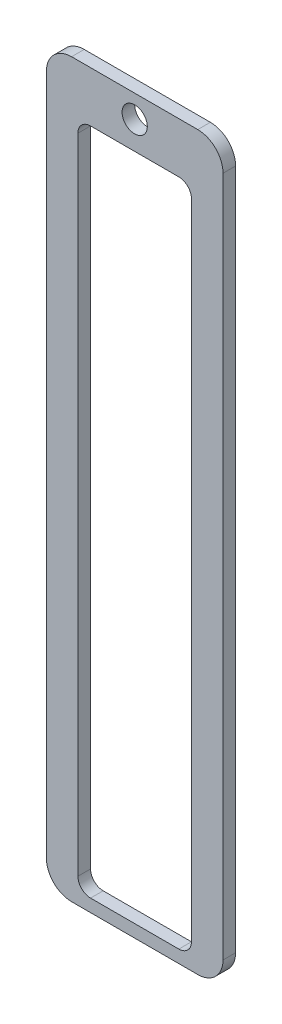
ISO-10303-21;
HEADER;
FILE_DESCRIPTION(('STEP AP214'),'2;1');
FILE_NAME('part.step','',(''),(''),'','','');
FILE_SCHEMA(('AUTOMOTIVE_DESIGN { 1 0 10303 214 1 1 1 1 }'));
ENDSEC;
DATA;
#1=APPLICATION_CONTEXT('core data for automotive mechanical design processes');
#2=APPLICATION_PROTOCOL_DEFINITION('international standard','automotive_design',2000,#1);
#3=PRODUCT_CONTEXT('',#1,'mechanical');
#4=PRODUCT('Part','Part','',(#3));
#5=PRODUCT_RELATED_PRODUCT_CATEGORY('part','',(#4));
#6=PRODUCT_DEFINITION_FORMATION('','',#4);
#7=PRODUCT_DEFINITION_CONTEXT('part definition',#1,'design');
#8=PRODUCT_DEFINITION('design','',#6,#7);
#9=PRODUCT_DEFINITION_SHAPE('','',#8);
#10=(LENGTH_UNIT() NAMED_UNIT(*) SI_UNIT(.MILLI.,.METRE.));
#11=(NAMED_UNIT(*) PLANE_ANGLE_UNIT() SI_UNIT($,.RADIAN.));
#12=(NAMED_UNIT(*) SI_UNIT($,.STERADIAN.) SOLID_ANGLE_UNIT());
#13=UNCERTAINTY_MEASURE_WITH_UNIT(LENGTH_MEASURE(1.E-05),#10,'distance_accuracy_value','');
#14=(GEOMETRIC_REPRESENTATION_CONTEXT(3) GLOBAL_UNCERTAINTY_ASSIGNED_CONTEXT((#13)) GLOBAL_UNIT_ASSIGNED_CONTEXT((#10,
#11,#12)) REPRESENTATION_CONTEXT('',''));
#15=CARTESIAN_POINT('',(0.,0.,0.));
#16=DIRECTION('',(0.,0.,1.));
#17=DIRECTION('',(1.,0.,0.));
#18=AXIS2_PLACEMENT_3D('',#15,#16,#17);
#19=CARTESIAN_POINT('',(25.,-280.,5.));
#20=DIRECTION('',(0.,0.,-1.));
#21=DIRECTION('',(-1.,0.,0.));
#22=AXIS2_PLACEMENT_3D('',#19,#20,#21);
#23=CYLINDRICAL_SURFACE('',#22,10.);
#24=CARTESIAN_POINT('',(25.,-280.,0.));
#25=DIRECTION('',(0.,0.,1.));
#26=DIRECTION('',(1.,0.,0.));
#27=AXIS2_PLACEMENT_3D('',#24,#25,#26);
#28=CIRCLE('',#27,10.);
#29=CARTESIAN_POINT('',(25.,-290.,0.));
#30=VERTEX_POINT('',#29);
#31=CARTESIAN_POINT('',(35.,-280.,0.));
#32=VERTEX_POINT('',#31);
#33=EDGE_CURVE('E247',#30,#32,#28,.T.);
#34=ORIENTED_EDGE('',*,*,#33,.T.);
#35=DIRECTION('',(0.,0.,-1.));
#36=VECTOR('',#35,1.);
#37=CARTESIAN_POINT('',(35.,-280.,5.));
#38=LINE('',#37,#36);
#39=CARTESIAN_POINT('',(35.,-280.,5.));
#40=VERTEX_POINT('',#39);
#41=EDGE_CURVE('E11',#40,#32,#38,.T.);
#42=ORIENTED_EDGE('',*,*,#41,.F.);
#43=CARTESIAN_POINT('',(25.,-280.,5.));
#44=DIRECTION('',(0.,0.,1.));
#45=DIRECTION('',(1.,0.,0.));
#46=AXIS2_PLACEMENT_3D('',#43,#44,#45);
#47=CIRCLE('',#46,10.);
#48=CARTESIAN_POINT('',(25.,-290.,5.));
#49=VERTEX_POINT('',#48);
#50=EDGE_CURVE('E220',#49,#40,#47,.T.);
#51=ORIENTED_EDGE('',*,*,#50,.F.);
#52=DIRECTION('',(0.,0.,-1.));
#53=VECTOR('',#52,1.);
#54=CARTESIAN_POINT('',(25.,-290.,5.));
#55=LINE('',#54,#53);
#56=EDGE_CURVE('E246',#49,#30,#55,.T.);
#57=ORIENTED_EDGE('',*,*,#56,.T.);
#58=EDGE_LOOP('',(#34,#42,#51,#57));
#59=FACE_BOUND('',#58,.T.);
#60=ADVANCED_FACE('F43',(#59),#23,.T.);
#61=CARTESIAN_POINT('',(35.,-280.,5.));
#62=DIRECTION('',(-1.,0.,0.));
#63=DIRECTION('',(0.,-1.,0.));
#64=AXIS2_PLACEMENT_3D('',#61,#62,#63);
#65=PLANE('',#64);
#66=DIRECTION('',(0.,1.,0.));
#67=VECTOR('',#66,1.);
#68=CARTESIAN_POINT('',(35.,-280.,0.));
#69=LINE('',#68,#67);
#70=CARTESIAN_POINT('',(35.,-10.,0.));
#71=VERTEX_POINT('',#70);
#72=EDGE_CURVE('E251',#32,#71,#69,.T.);
#73=ORIENTED_EDGE('',*,*,#72,.T.);
#74=DIRECTION('',(0.,0.,-1.));
#75=VECTOR('',#74,1.);
#76=CARTESIAN_POINT('',(35.,-10.,5.));
#77=LINE('',#76,#75);
#78=CARTESIAN_POINT('',(35.,-10.,5.));
#79=VERTEX_POINT('',#78);
#80=EDGE_CURVE('E51',#79,#71,#77,.T.);
#81=ORIENTED_EDGE('',*,*,#80,.F.);
#82=DIRECTION('',(0.,1.,0.));
#83=VECTOR('',#82,1.);
#84=CARTESIAN_POINT('',(35.,-280.,5.));
#85=LINE('',#84,#83);
#86=EDGE_CURVE('E224',#40,#79,#85,.T.);
#87=ORIENTED_EDGE('',*,*,#86,.F.);
#88=ORIENTED_EDGE('',*,*,#41,.T.);
#89=EDGE_LOOP('',(#73,#81,#87,#88));
#90=FACE_BOUND('',#89,.T.);
#91=ADVANCED_FACE('F320',(#90),#65,.F.);
#92=CARTESIAN_POINT('',(25.,-10.,5.));
#93=DIRECTION('',(0.,0.,-1.));
#94=DIRECTION('',(-1.,0.,0.));
#95=AXIS2_PLACEMENT_3D('',#92,#93,#94);
#96=CYLINDRICAL_SURFACE('',#95,10.);
#97=CARTESIAN_POINT('',(25.,-10.,0.));
#98=DIRECTION('',(0.,0.,1.));
#99=DIRECTION('',(-1.,0.,0.));
#100=AXIS2_PLACEMENT_3D('',#97,#98,#99);
#101=CIRCLE('',#100,10.);
#102=CARTESIAN_POINT('',(25.,0.,0.));
#103=VERTEX_POINT('',#102);
#104=EDGE_CURVE('E254',#71,#103,#101,.T.);
#105=ORIENTED_EDGE('',*,*,#104,.T.);
#106=DIRECTION('',(0.,0.,-1.));
#107=VECTOR('',#106,1.);
#108=CARTESIAN_POINT('',(25.,0.,5.));
#109=LINE('',#108,#107);
#110=CARTESIAN_POINT('',(25.,0.,5.));
#111=VERTEX_POINT('',#110);
#112=EDGE_CURVE('E290',#111,#103,#109,.T.);
#113=ORIENTED_EDGE('',*,*,#112,.F.);
#114=CARTESIAN_POINT('',(25.,-10.,5.));
#115=DIRECTION('',(0.,0.,1.));
#116=DIRECTION('',(-1.,0.,0.));
#117=AXIS2_PLACEMENT_3D('',#114,#115,#116);
#118=CIRCLE('',#117,10.);
#119=EDGE_CURVE('E228',#79,#111,#118,.T.);
#120=ORIENTED_EDGE('',*,*,#119,.F.);
#121=ORIENTED_EDGE('',*,*,#80,.T.);
#122=EDGE_LOOP('',(#105,#113,#120,#121));
#123=FACE_BOUND('',#122,.T.);
#124=ADVANCED_FACE('F299',(#123),#96,.T.);
#125=CARTESIAN_POINT('',(-25.,0.,5.));
#126=DIRECTION('',(0.,-1.,0.));
#127=DIRECTION('',(0.,0.,-1.));
#128=AXIS2_PLACEMENT_3D('',#125,#126,#127);
#129=PLANE('',#128);
#130=DIRECTION('',(-1.,0.,0.));
#131=VECTOR('',#130,1.);
#132=CARTESIAN_POINT('',(-25.,0.,0.));
#133=LINE('',#132,#131);
#134=CARTESIAN_POINT('',(-25.,0.,0.));
#135=VERTEX_POINT('',#134);
#136=EDGE_CURVE('E257',#103,#135,#133,.T.);
#137=ORIENTED_EDGE('',*,*,#136,.T.);
#138=DIRECTION('',(0.,0.,-1.));
#139=VECTOR('',#138,1.);
#140=CARTESIAN_POINT('',(-25.,0.,5.));
#141=LINE('',#140,#139);
#142=CARTESIAN_POINT('',(-25.,0.,5.));
#143=VERTEX_POINT('',#142);
#144=EDGE_CURVE('E286',#143,#135,#141,.T.);
#145=ORIENTED_EDGE('',*,*,#144,.F.);
#146=DIRECTION('',(-1.,0.,0.));
#147=VECTOR('',#146,1.);
#148=CARTESIAN_POINT('',(-25.,0.,5.));
#149=LINE('',#148,#147);
#150=EDGE_CURVE('E231',#111,#143,#149,.T.);
#151=ORIENTED_EDGE('',*,*,#150,.F.);
#152=ORIENTED_EDGE('',*,*,#112,.T.);
#153=EDGE_LOOP('',(#137,#145,#151,#152));
#154=FACE_BOUND('',#153,.T.);
#155=ADVANCED_FACE('F310',(#154),#129,.F.);
#156=CARTESIAN_POINT('',(-25.,-10.,5.));
#157=DIRECTION('',(0.,0.,-1.));
#158=DIRECTION('',(-1.,0.,0.));
#159=AXIS2_PLACEMENT_3D('',#156,#157,#158);
#160=CYLINDRICAL_SURFACE('',#159,10.);
#161=CARTESIAN_POINT('',(-25.,-10.,0.));
#162=DIRECTION('',(0.,0.,1.));
#163=DIRECTION('',(-1.,0.,0.));
#164=AXIS2_PLACEMENT_3D('',#161,#162,#163);
#165=CIRCLE('',#164,10.);
#166=CARTESIAN_POINT('',(-35.,-10.,0.));
#167=VERTEX_POINT('',#166);
#168=EDGE_CURVE('E260',#135,#167,#165,.T.);
#169=ORIENTED_EDGE('',*,*,#168,.T.);
#170=DIRECTION('',(0.,0.,-1.));
#171=VECTOR('',#170,1.);
#172=CARTESIAN_POINT('',(-35.,-10.,5.));
#173=LINE('',#172,#171);
#174=CARTESIAN_POINT('',(-35.,-10.,5.));
#175=VERTEX_POINT('',#174);
#176=EDGE_CURVE('E282',#175,#167,#173,.T.);
#177=ORIENTED_EDGE('',*,*,#176,.F.);
#178=CARTESIAN_POINT('',(-25.,-10.,5.));
#179=DIRECTION('',(0.,0.,1.));
#180=DIRECTION('',(-1.,0.,0.));
#181=AXIS2_PLACEMENT_3D('',#178,#179,#180);
#182=CIRCLE('',#181,10.);
#183=EDGE_CURVE('E234',#143,#175,#182,.T.);
#184=ORIENTED_EDGE('',*,*,#183,.F.);
#185=ORIENTED_EDGE('',*,*,#144,.T.);
#186=EDGE_LOOP('',(#169,#177,#184,#185));
#187=FACE_BOUND('',#186,.T.);
#188=ADVANCED_FACE('F314',(#187),#160,.T.);
#189=CARTESIAN_POINT('',(-35.,-280.,5.));
#190=DIRECTION('',(1.,0.,0.));
#191=DIRECTION('',(0.,1.,0.));
#192=AXIS2_PLACEMENT_3D('',#189,#190,#191);
#193=PLANE('',#192);
#194=DIRECTION('',(0.,-1.,0.));
#195=VECTOR('',#194,1.);
#196=CARTESIAN_POINT('',(-35.,-280.,0.));
#197=LINE('',#196,#195);
#198=CARTESIAN_POINT('',(-35.,-280.,0.));
#199=VERTEX_POINT('',#198);
#200=EDGE_CURVE('E263',#167,#199,#197,.T.);
#201=ORIENTED_EDGE('',*,*,#200,.T.);
#202=DIRECTION('',(0.,0.,-1.));
#203=VECTOR('',#202,1.);
#204=CARTESIAN_POINT('',(-35.,-280.,5.));
#205=LINE('',#204,#203);
#206=CARTESIAN_POINT('',(-35.,-280.,5.));
#207=VERTEX_POINT('',#206);
#208=EDGE_CURVE('E278',#207,#199,#205,.T.);
#209=ORIENTED_EDGE('',*,*,#208,.F.);
#210=DIRECTION('',(0.,-1.,0.));
#211=VECTOR('',#210,1.);
#212=CARTESIAN_POINT('',(-35.,-280.,5.));
#213=LINE('',#212,#211);
#214=EDGE_CURVE('E237',#175,#207,#213,.T.);
#215=ORIENTED_EDGE('',*,*,#214,.F.);
#216=ORIENTED_EDGE('',*,*,#176,.T.);
#217=EDGE_LOOP('',(#201,#209,#215,#216));
#218=FACE_BOUND('',#217,.T.);
#219=ADVANCED_FACE('F333',(#218),#193,.F.);
#220=CARTESIAN_POINT('',(-25.,-280.,5.));
#221=DIRECTION('',(0.,0.,-1.));
#222=DIRECTION('',(-1.,0.,0.));
#223=AXIS2_PLACEMENT_3D('',#220,#221,#222);
#224=CYLINDRICAL_SURFACE('',#223,10.);
#225=CARTESIAN_POINT('',(-25.,-280.,0.));
#226=DIRECTION('',(0.,0.,1.));
#227=DIRECTION('',(-1.,0.,0.));
#228=AXIS2_PLACEMENT_3D('',#225,#226,#227);
#229=CIRCLE('',#228,10.);
#230=CARTESIAN_POINT('',(-25.,-290.,0.));
#231=VERTEX_POINT('',#230);
#232=EDGE_CURVE('E266',#199,#231,#229,.T.);
#233=ORIENTED_EDGE('',*,*,#232,.T.);
#234=DIRECTION('',(0.,0.,-1.));
#235=VECTOR('',#234,1.);
#236=CARTESIAN_POINT('',(-25.,-290.,5.));
#237=LINE('',#236,#235);
#238=CARTESIAN_POINT('',(-25.,-290.,5.));
#239=VERTEX_POINT('',#238);
#240=EDGE_CURVE('E274',#239,#231,#237,.T.);
#241=ORIENTED_EDGE('',*,*,#240,.F.);
#242=CARTESIAN_POINT('',(-25.,-280.,5.));
#243=DIRECTION('',(0.,0.,1.));
#244=DIRECTION('',(-1.,0.,0.));
#245=AXIS2_PLACEMENT_3D('',#242,#243,#244);
#246=CIRCLE('',#245,10.);
#247=EDGE_CURVE('E240',#207,#239,#246,.T.);
#248=ORIENTED_EDGE('',*,*,#247,.F.);
#249=ORIENTED_EDGE('',*,*,#208,.T.);
#250=EDGE_LOOP('',(#233,#241,#248,#249));
#251=FACE_BOUND('',#250,.T.);
#252=ADVANCED_FACE('F331',(#251),#224,.T.);
#253=CARTESIAN_POINT('',(-25.,-290.,5.));
#254=DIRECTION('',(0.,1.,0.));
#255=DIRECTION('',(0.,0.,1.));
#256=AXIS2_PLACEMENT_3D('',#253,#254,#255);
#257=PLANE('',#256);
#258=DIRECTION('',(1.,0.,0.));
#259=VECTOR('',#258,1.);
#260=CARTESIAN_POINT('',(-25.,-290.,0.));
#261=LINE('',#260,#259);
#262=EDGE_CURVE('E225',#231,#30,#261,.T.);
#263=ORIENTED_EDGE('',*,*,#262,.T.);
#264=ORIENTED_EDGE('',*,*,#56,.F.);
#265=DIRECTION('',(1.,0.,0.));
#266=VECTOR('',#265,1.);
#267=CARTESIAN_POINT('',(-25.,-290.,5.));
#268=LINE('',#267,#266);
#269=EDGE_CURVE('E243',#239,#49,#268,.T.);
#270=ORIENTED_EDGE('',*,*,#269,.F.);
#271=ORIENTED_EDGE('',*,*,#240,.T.);
#272=EDGE_LOOP('',(#263,#264,#270,#271));
#273=FACE_BOUND('',#272,.T.);
#274=ADVANCED_FACE('F326',(#273),#257,.F.);
#275=CARTESIAN_POINT('',(25.,-280.,5.));
#276=DIRECTION('',(0.,0.,1.));
#277=DIRECTION('',(1.,0.,0.));
#278=AXIS2_PLACEMENT_3D('',#275,#276,#277);
#279=PLANE('',#278);
#280=CARTESIAN_POINT('',(0.,-9.00000000000001,5.));
#281=DIRECTION('',(0.,0.,1.));
#282=DIRECTION('',(1.,0.,0.));
#283=AXIS2_PLACEMENT_3D('',#280,#281,#282);
#284=CIRCLE('',#283,5.);
#285=CARTESIAN_POINT('',(4.99999999999999,-9.00000000000001,5.));
#286=VERTEX_POINT('',#285);
#287=EDGE_CURVE('E181',#286,#286,#284,.T.);
#288=ORIENTED_EDGE('',*,*,#287,.F.);
#289=EDGE_LOOP('',(#288));
#290=FACE_BOUND('',#289,.T.);
#291=CARTESIAN_POINT('',(17.5,-280.,5.));
#292=DIRECTION('',(0.,0.,1.));
#293=DIRECTION('',(1.,0.,0.));
#294=AXIS2_PLACEMENT_3D('',#291,#292,#293);
#295=CIRCLE('',#294,5.);
#296=CARTESIAN_POINT('',(17.5,-285.,5.));
#297=VERTEX_POINT('',#296);
#298=CARTESIAN_POINT('',(22.5,-280.,5.));
#299=VERTEX_POINT('',#298);
#300=EDGE_CURVE('E58',#297,#299,#295,.T.);
#301=ORIENTED_EDGE('',*,*,#300,.F.);
#302=DIRECTION('',(1.,0.,0.));
#303=VECTOR('',#302,1.);
#304=CARTESIAN_POINT('',(-17.5,-285.,5.));
#305=LINE('',#304,#303);
#306=CARTESIAN_POINT('',(-17.5,-285.,5.));
#307=VERTEX_POINT('',#306);
#308=EDGE_CURVE('E166',#307,#297,#305,.T.);
#309=ORIENTED_EDGE('',*,*,#308,.F.);
#310=CARTESIAN_POINT('',(-17.5,-280.,5.));
#311=DIRECTION('',(0.,0.,1.));
#312=DIRECTION('',(1.,0.,0.));
#313=AXIS2_PLACEMENT_3D('',#310,#311,#312);
#314=CIRCLE('',#313,5.);
#315=CARTESIAN_POINT('',(-22.5,-280.,5.));
#316=VERTEX_POINT('',#315);
#317=EDGE_CURVE('E172',#316,#307,#314,.T.);
#318=ORIENTED_EDGE('',*,*,#317,.F.);
#319=DIRECTION('',(0.,-1.,0.));
#320=VECTOR('',#319,1.);
#321=CARTESIAN_POINT('',(-22.5,-25.,5.));
#322=LINE('',#321,#320);
#323=CARTESIAN_POINT('',(-22.5,-25.,5.));
#324=VERTEX_POINT('',#323);
#325=EDGE_CURVE('E565',#324,#316,#322,.T.);
#326=ORIENTED_EDGE('',*,*,#325,.F.);
#327=CARTESIAN_POINT('',(-17.5,-25.,5.));
#328=DIRECTION('',(0.,0.,1.));
#329=DIRECTION('',(1.,0.,0.));
#330=AXIS2_PLACEMENT_3D('',#327,#328,#329);
#331=CIRCLE('',#330,5.);
#332=CARTESIAN_POINT('',(-17.5,-20.,5.));
#333=VERTEX_POINT('',#332);
#334=EDGE_CURVE('E569',#333,#324,#331,.T.);
#335=ORIENTED_EDGE('',*,*,#334,.F.);
#336=DIRECTION('',(-1.,0.,0.));
#337=VECTOR('',#336,1.);
#338=CARTESIAN_POINT('',(-17.5,-20.,5.));
#339=LINE('',#338,#337);
#340=CARTESIAN_POINT('',(17.5,-20.,5.));
#341=VERTEX_POINT('',#340);
#342=EDGE_CURVE('E573',#341,#333,#339,.T.);
#343=ORIENTED_EDGE('',*,*,#342,.F.);
#344=CARTESIAN_POINT('',(17.5,-25.,5.));
#345=DIRECTION('',(0.,0.,1.));
#346=DIRECTION('',(-1.,0.,0.));
#347=AXIS2_PLACEMENT_3D('',#344,#345,#346);
#348=CIRCLE('',#347,5.);
#349=CARTESIAN_POINT('',(22.5,-25.,5.));
#350=VERTEX_POINT('',#349);
#351=EDGE_CURVE('E188',#350,#341,#348,.T.);
#352=ORIENTED_EDGE('',*,*,#351,.F.);
#353=DIRECTION('',(0.,1.,0.));
#354=VECTOR('',#353,1.);
#355=CARTESIAN_POINT('',(22.5,-25.,5.));
#356=LINE('',#355,#354);
#357=EDGE_CURVE('E179',#299,#350,#356,.T.);
#358=ORIENTED_EDGE('',*,*,#357,.F.);
#359=EDGE_LOOP('',(#301,#309,#318,#326,#335,#343,#352,#358));
#360=FACE_BOUND('',#359,.T.);
#361=ORIENTED_EDGE('',*,*,#50,.T.);
#362=ORIENTED_EDGE('',*,*,#86,.T.);
#363=ORIENTED_EDGE('',*,*,#119,.T.);
#364=ORIENTED_EDGE('',*,*,#150,.T.);
#365=ORIENTED_EDGE('',*,*,#183,.T.);
#366=ORIENTED_EDGE('',*,*,#214,.T.);
#367=ORIENTED_EDGE('',*,*,#247,.T.);
#368=ORIENTED_EDGE('',*,*,#269,.T.);
#369=EDGE_LOOP('',(#361,#362,#363,#364,#365,#366,#367,#368));
#370=FACE_BOUND('',#369,.T.);
#371=ADVANCED_FACE('F175',(#290,#360,#370),#279,.T.);
#372=CARTESIAN_POINT('',(25.,-280.,0.));
#373=DIRECTION('',(0.,0.,1.));
#374=DIRECTION('',(1.,0.,0.));
#375=AXIS2_PLACEMENT_3D('',#372,#373,#374);
#376=PLANE('',#375);
#377=CARTESIAN_POINT('',(0.,-9.00000000000001,0.));
#378=DIRECTION('',(0.,0.,1.));
#379=DIRECTION('',(1.,0.,0.));
#380=AXIS2_PLACEMENT_3D('',#377,#378,#379);
#381=CIRCLE('',#380,5.);
#382=CARTESIAN_POINT('',(4.99999999999999,-9.00000000000001,0.));
#383=VERTEX_POINT('',#382);
#384=EDGE_CURVE('E186',#383,#383,#381,.T.);
#385=ORIENTED_EDGE('',*,*,#384,.T.);
#386=EDGE_LOOP('',(#385));
#387=FACE_BOUND('',#386,.T.);
#388=DIRECTION('',(1.,0.,0.));
#389=VECTOR('',#388,1.);
#390=CARTESIAN_POINT('',(-17.5,-285.,0.));
#391=LINE('',#390,#389);
#392=CARTESIAN_POINT('',(-17.5,-285.,0.));
#393=VERTEX_POINT('',#392);
#394=CARTESIAN_POINT('',(17.5,-285.,0.));
#395=VERTEX_POINT('',#394);
#396=EDGE_CURVE('E192',#393,#395,#391,.T.);
#397=ORIENTED_EDGE('',*,*,#396,.T.);
#398=CARTESIAN_POINT('',(17.5,-280.,0.));
#399=DIRECTION('',(0.,0.,1.));
#400=DIRECTION('',(1.,0.,0.));
#401=AXIS2_PLACEMENT_3D('',#398,#399,#400);
#402=CIRCLE('',#401,5.);
#403=CARTESIAN_POINT('',(22.5,-280.,0.));
#404=VERTEX_POINT('',#403);
#405=EDGE_CURVE('E158',#395,#404,#402,.T.);
#406=ORIENTED_EDGE('',*,*,#405,.T.);
#407=DIRECTION('',(0.,1.,0.));
#408=VECTOR('',#407,1.);
#409=CARTESIAN_POINT('',(22.5,-25.,0.));
#410=LINE('',#409,#408);
#411=CARTESIAN_POINT('',(22.5,-25.,0.));
#412=VERTEX_POINT('',#411);
#413=EDGE_CURVE('E214',#404,#412,#410,.T.);
#414=ORIENTED_EDGE('',*,*,#413,.T.);
#415=CARTESIAN_POINT('',(17.5,-25.,0.));
#416=DIRECTION('',(0.,0.,1.));
#417=DIRECTION('',(-1.,0.,0.));
#418=AXIS2_PLACEMENT_3D('',#415,#416,#417);
#419=CIRCLE('',#418,5.);
#420=CARTESIAN_POINT('',(17.5,-20.,0.));
#421=VERTEX_POINT('',#420);
#422=EDGE_CURVE('E66',#412,#421,#419,.T.);
#423=ORIENTED_EDGE('',*,*,#422,.T.);
#424=DIRECTION('',(-1.,0.,0.));
#425=VECTOR('',#424,1.);
#426=CARTESIAN_POINT('',(-17.5,-20.,0.));
#427=LINE('',#426,#425);
#428=CARTESIAN_POINT('',(-17.5,-20.,0.));
#429=VERTEX_POINT('',#428);
#430=EDGE_CURVE('E208',#421,#429,#427,.T.);
#431=ORIENTED_EDGE('',*,*,#430,.T.);
#432=CARTESIAN_POINT('',(-17.5,-25.,0.));
#433=DIRECTION('',(0.,0.,1.));
#434=DIRECTION('',(1.,0.,0.));
#435=AXIS2_PLACEMENT_3D('',#432,#433,#434);
#436=CIRCLE('',#435,5.);
#437=CARTESIAN_POINT('',(-22.5,-25.,0.));
#438=VERTEX_POINT('',#437);
#439=EDGE_CURVE('E204',#429,#438,#436,.T.);
#440=ORIENTED_EDGE('',*,*,#439,.T.);
#441=DIRECTION('',(0.,-1.,0.));
#442=VECTOR('',#441,1.);
#443=CARTESIAN_POINT('',(-22.5,-25.,0.));
#444=LINE('',#443,#442);
#445=CARTESIAN_POINT('',(-22.5,-280.,0.));
#446=VERTEX_POINT('',#445);
#447=EDGE_CURVE('E200',#438,#446,#444,.T.);
#448=ORIENTED_EDGE('',*,*,#447,.T.);
#449=CARTESIAN_POINT('',(-17.5,-280.,0.));
#450=DIRECTION('',(0.,0.,1.));
#451=DIRECTION('',(1.,0.,0.));
#452=AXIS2_PLACEMENT_3D('',#449,#450,#451);
#453=CIRCLE('',#452,5.);
#454=EDGE_CURVE('E195',#446,#393,#453,.T.);
#455=ORIENTED_EDGE('',*,*,#454,.T.);
#456=EDGE_LOOP('',(#397,#406,#414,#423,#431,#440,#448,#455));
#457=FACE_BOUND('',#456,.T.);
#458=ORIENTED_EDGE('',*,*,#33,.F.);
#459=ORIENTED_EDGE('',*,*,#262,.F.);
#460=ORIENTED_EDGE('',*,*,#232,.F.);
#461=ORIENTED_EDGE('',*,*,#200,.F.);
#462=ORIENTED_EDGE('',*,*,#168,.F.);
#463=ORIENTED_EDGE('',*,*,#136,.F.);
#464=ORIENTED_EDGE('',*,*,#104,.F.);
#465=ORIENTED_EDGE('',*,*,#72,.F.);
#466=EDGE_LOOP('',(#458,#459,#460,#461,#462,#463,#464,#465));
#467=FACE_BOUND('',#466,.T.);
#468=ADVANCED_FACE('F305',(#387,#457,#467),#376,.F.);
#469=CARTESIAN_POINT('',(17.5,-280.,0.));
#470=DIRECTION('',(0.,0.,1.));
#471=DIRECTION('',(1.,0.,0.));
#472=AXIS2_PLACEMENT_3D('',#469,#470,#471);
#473=CYLINDRICAL_SURFACE('',#472,5.);
#474=ORIENTED_EDGE('',*,*,#300,.T.);
#475=DIRECTION('',(0.,0.,1.));
#476=VECTOR('',#475,1.);
#477=CARTESIAN_POINT('',(22.5,-280.,0.));
#478=LINE('',#477,#476);
#479=EDGE_CURVE('E196',#404,#299,#478,.T.);
#480=ORIENTED_EDGE('',*,*,#479,.F.);
#481=ORIENTED_EDGE('',*,*,#405,.F.);
#482=DIRECTION('',(0.,0.,1.));
#483=VECTOR('',#482,1.);
#484=CARTESIAN_POINT('',(17.5,-285.,0.));
#485=LINE('',#484,#483);
#486=EDGE_CURVE('E154',#395,#297,#485,.T.);
#487=ORIENTED_EDGE('',*,*,#486,.T.);
#488=EDGE_LOOP('',(#474,#480,#481,#487));
#489=FACE_BOUND('',#488,.T.);
#490=ADVANCED_FACE('F156',(#489),#473,.F.);
#491=CARTESIAN_POINT('',(-17.5,-285.,0.));
#492=DIRECTION('',(0.,-1.,0.));
#493=DIRECTION('',(0.,0.,-1.));
#494=AXIS2_PLACEMENT_3D('',#491,#492,#493);
#495=PLANE('',#494);
#496=ORIENTED_EDGE('',*,*,#308,.T.);
#497=ORIENTED_EDGE('',*,*,#486,.F.);
#498=ORIENTED_EDGE('',*,*,#396,.F.);
#499=DIRECTION('',(0.,0.,1.));
#500=VECTOR('',#499,1.);
#501=CARTESIAN_POINT('',(-17.5,-285.,0.));
#502=LINE('',#501,#500);
#503=EDGE_CURVE('E163',#393,#307,#502,.T.);
#504=ORIENTED_EDGE('',*,*,#503,.T.);
#505=EDGE_LOOP('',(#496,#497,#498,#504));
#506=FACE_BOUND('',#505,.T.);
#507=ADVANCED_FACE('F167',(#506),#495,.F.);
#508=CARTESIAN_POINT('',(-17.5,-280.,0.));
#509=DIRECTION('',(0.,0.,1.));
#510=DIRECTION('',(1.,0.,0.));
#511=AXIS2_PLACEMENT_3D('',#508,#509,#510);
#512=CYLINDRICAL_SURFACE('',#511,5.);
#513=ORIENTED_EDGE('',*,*,#317,.T.);
#514=ORIENTED_EDGE('',*,*,#503,.F.);
#515=ORIENTED_EDGE('',*,*,#454,.F.);
#516=DIRECTION('',(0.,0.,1.));
#517=VECTOR('',#516,1.);
#518=CARTESIAN_POINT('',(-22.5,-280.,0.));
#519=LINE('',#518,#517);
#520=EDGE_CURVE('E558',#446,#316,#519,.T.);
#521=ORIENTED_EDGE('',*,*,#520,.T.);
#522=EDGE_LOOP('',(#513,#514,#515,#521));
#523=FACE_BOUND('',#522,.T.);
#524=ADVANCED_FACE('F420',(#523),#512,.F.);
#525=CARTESIAN_POINT('',(-22.5,-25.,0.));
#526=DIRECTION('',(-1.,0.,0.));
#527=DIRECTION('',(0.,-1.,0.));
#528=AXIS2_PLACEMENT_3D('',#525,#526,#527);
#529=PLANE('',#528);
#530=ORIENTED_EDGE('',*,*,#325,.T.);
#531=ORIENTED_EDGE('',*,*,#520,.F.);
#532=ORIENTED_EDGE('',*,*,#447,.F.);
#533=DIRECTION('',(0.,0.,1.));
#534=VECTOR('',#533,1.);
#535=CARTESIAN_POINT('',(-22.5,-25.,0.));
#536=LINE('',#535,#534);
#537=EDGE_CURVE('E555',#438,#324,#536,.T.);
#538=ORIENTED_EDGE('',*,*,#537,.T.);
#539=EDGE_LOOP('',(#530,#531,#532,#538));
#540=FACE_BOUND('',#539,.T.);
#541=ADVANCED_FACE('F430',(#540),#529,.F.);
#542=CARTESIAN_POINT('',(-17.5,-25.,0.));
#543=DIRECTION('',(0.,0.,1.));
#544=DIRECTION('',(1.,0.,0.));
#545=AXIS2_PLACEMENT_3D('',#542,#543,#544);
#546=CYLINDRICAL_SURFACE('',#545,5.);
#547=ORIENTED_EDGE('',*,*,#334,.T.);
#548=ORIENTED_EDGE('',*,*,#537,.F.);
#549=ORIENTED_EDGE('',*,*,#439,.F.);
#550=DIRECTION('',(0.,0.,1.));
#551=VECTOR('',#550,1.);
#552=CARTESIAN_POINT('',(-17.5,-20.,0.));
#553=LINE('',#552,#551);
#554=EDGE_CURVE('E552',#429,#333,#553,.T.);
#555=ORIENTED_EDGE('',*,*,#554,.T.);
#556=EDGE_LOOP('',(#547,#548,#549,#555));
#557=FACE_BOUND('',#556,.T.);
#558=ADVANCED_FACE('F441',(#557),#546,.F.);
#559=CARTESIAN_POINT('',(-17.5,-20.,0.));
#560=DIRECTION('',(0.,1.,0.));
#561=DIRECTION('',(0.,0.,1.));
#562=AXIS2_PLACEMENT_3D('',#559,#560,#561);
#563=PLANE('',#562);
#564=ORIENTED_EDGE('',*,*,#342,.T.);
#565=ORIENTED_EDGE('',*,*,#554,.F.);
#566=ORIENTED_EDGE('',*,*,#430,.F.);
#567=DIRECTION('',(0.,0.,1.));
#568=VECTOR('',#567,1.);
#569=CARTESIAN_POINT('',(17.5,-20.,0.));
#570=LINE('',#569,#568);
#571=EDGE_CURVE('E549',#421,#341,#570,.T.);
#572=ORIENTED_EDGE('',*,*,#571,.T.);
#573=EDGE_LOOP('',(#564,#565,#566,#572));
#574=FACE_BOUND('',#573,.T.);
#575=ADVANCED_FACE('F452',(#574),#563,.F.);
#576=CARTESIAN_POINT('',(17.5,-25.,0.));
#577=DIRECTION('',(0.,0.,1.));
#578=DIRECTION('',(1.,0.,0.));
#579=AXIS2_PLACEMENT_3D('',#576,#577,#578);
#580=CYLINDRICAL_SURFACE('',#579,5.);
#581=ORIENTED_EDGE('',*,*,#351,.T.);
#582=ORIENTED_EDGE('',*,*,#571,.F.);
#583=ORIENTED_EDGE('',*,*,#422,.F.);
#584=DIRECTION('',(0.,0.,1.));
#585=VECTOR('',#584,1.);
#586=CARTESIAN_POINT('',(22.5,-25.,0.));
#587=LINE('',#586,#585);
#588=EDGE_CURVE('E546',#412,#350,#587,.T.);
#589=ORIENTED_EDGE('',*,*,#588,.T.);
#590=EDGE_LOOP('',(#581,#582,#583,#589));
#591=FACE_BOUND('',#590,.T.);
#592=ADVANCED_FACE('F463',(#591),#580,.F.);
#593=CARTESIAN_POINT('',(22.5,-25.,0.));
#594=DIRECTION('',(1.,0.,0.));
#595=DIRECTION('',(0.,1.,0.));
#596=AXIS2_PLACEMENT_3D('',#593,#594,#595);
#597=PLANE('',#596);
#598=ORIENTED_EDGE('',*,*,#357,.T.);
#599=ORIENTED_EDGE('',*,*,#588,.F.);
#600=ORIENTED_EDGE('',*,*,#413,.F.);
#601=ORIENTED_EDGE('',*,*,#479,.T.);
#602=EDGE_LOOP('',(#598,#599,#600,#601));
#603=FACE_BOUND('',#602,.T.);
#604=ADVANCED_FACE('F474',(#603),#597,.F.);
#605=CARTESIAN_POINT('',(0.,-9.00000000000001,0.));
#606=DIRECTION('',(0.,0.,1.));
#607=DIRECTION('',(1.,0.,0.));
#608=AXIS2_PLACEMENT_3D('',#605,#606,#607);
#609=CYLINDRICAL_SURFACE('',#608,5.);
#610=ORIENTED_EDGE('',*,*,#384,.F.);
#611=EDGE_LOOP('',(#610));
#612=FACE_BOUND('',#611,.T.);
#613=ORIENTED_EDGE('',*,*,#287,.T.);
#614=EDGE_LOOP('',(#613));
#615=FACE_BOUND('',#614,.T.);
#616=ADVANCED_FACE('F484',(#612,#615),#609,.F.);
#617=CLOSED_SHELL('',(#60,#91,#124,#155,#188,#219,#252,#274,#371,#468,#490,#507,#524,#541,#558,
#575,#592,#604,#616));
#618=MANIFOLD_SOLID_BREP('B2',#617);
#619=ADVANCED_BREP_SHAPE_REPRESENTATION('',(#18,#618),#14);
#620=SHAPE_DEFINITION_REPRESENTATION(#9,#619);
ENDSEC;
END-ISO-10303-21;
